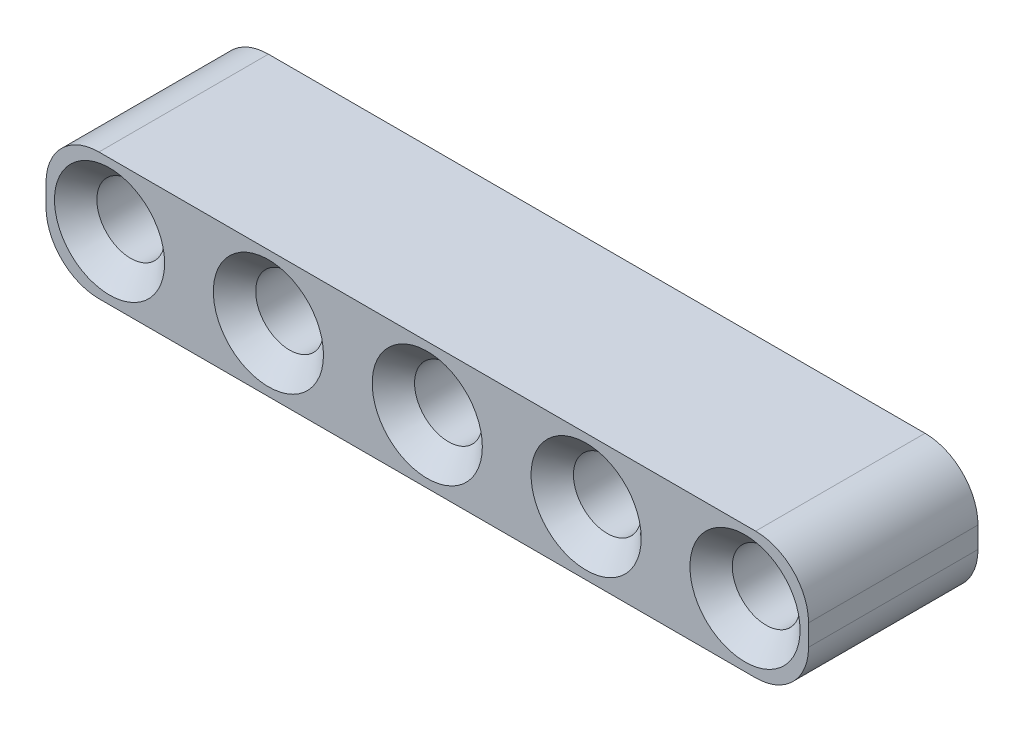
ISO-10303-21;
HEADER;
FILE_DESCRIPTION(('STEP AP214'),'2;1');
FILE_NAME('part.step','',(''),(''),'','','');
FILE_SCHEMA(('AUTOMOTIVE_DESIGN { 1 0 10303 214 1 1 1 1 }'));
ENDSEC;
DATA;
#1=APPLICATION_CONTEXT('core data for automotive mechanical design processes');
#2=APPLICATION_PROTOCOL_DEFINITION('international standard','automotive_design',2000,#1);
#3=PRODUCT_CONTEXT('',#1,'mechanical');
#4=PRODUCT('Part','Part','',(#3));
#5=PRODUCT_RELATED_PRODUCT_CATEGORY('part','',(#4));
#6=PRODUCT_DEFINITION_FORMATION('','',#4);
#7=PRODUCT_DEFINITION_CONTEXT('part definition',#1,'design');
#8=PRODUCT_DEFINITION('design','',#6,#7);
#9=PRODUCT_DEFINITION_SHAPE('','',#8);
#10=(LENGTH_UNIT() NAMED_UNIT(*) SI_UNIT(.MILLI.,.METRE.));
#11=(NAMED_UNIT(*) PLANE_ANGLE_UNIT() SI_UNIT($,.RADIAN.));
#12=(NAMED_UNIT(*) SI_UNIT($,.STERADIAN.) SOLID_ANGLE_UNIT());
#13=UNCERTAINTY_MEASURE_WITH_UNIT(LENGTH_MEASURE(1.E-05),#10,'distance_accuracy_value','');
#14=(GEOMETRIC_REPRESENTATION_CONTEXT(3) GLOBAL_UNCERTAINTY_ASSIGNED_CONTEXT((#13)) GLOBAL_UNIT_ASSIGNED_CONTEXT((#10,
#11,#12)) REPRESENTATION_CONTEXT('',''));
#15=CARTESIAN_POINT('',(0.,0.,0.));
#16=DIRECTION('',(0.,0.,1.));
#17=DIRECTION('',(1.,0.,0.));
#18=AXIS2_PLACEMENT_3D('',#15,#16,#17);
#19=CARTESIAN_POINT('',(30.5,-0.5,8.));
#20=DIRECTION('',(0.,0.,1.));
#21=DIRECTION('',(1.,0.,0.));
#22=AXIS2_PLACEMENT_3D('',#19,#20,#21);
#23=PLANE('',#22);
#24=CARTESIAN_POINT('',(30.,0.,8.));
#25=DIRECTION('',(0.,0.,1.));
#26=DIRECTION('',(1.,0.,0.));
#27=AXIS2_PLACEMENT_3D('',#24,#25,#26);
#28=CIRCLE('',#27,2.6);
#29=CARTESIAN_POINT('',(32.6,0.,8.));
#30=VERTEX_POINT('',#29);
#31=EDGE_CURVE('E192',#30,#30,#28,.F.);
#32=ORIENTED_EDGE('',*,*,#31,.T.);
#33=EDGE_LOOP('',(#32));
#34=FACE_BOUND('',#33,.T.);
#35=CARTESIAN_POINT('',(22.5,0.,8.));
#36=DIRECTION('',(0.,0.,1.));
#37=DIRECTION('',(1.,0.,0.));
#38=AXIS2_PLACEMENT_3D('',#35,#36,#37);
#39=CIRCLE('',#38,2.6);
#40=CARTESIAN_POINT('',(25.1,0.,8.));
#41=VERTEX_POINT('',#40);
#42=EDGE_CURVE('E189',#41,#41,#39,.F.);
#43=ORIENTED_EDGE('',*,*,#42,.T.);
#44=EDGE_LOOP('',(#43));
#45=FACE_BOUND('',#44,.T.);
#46=CARTESIAN_POINT('',(15.,0.,8.));
#47=DIRECTION('',(0.,0.,1.));
#48=DIRECTION('',(1.,0.,0.));
#49=AXIS2_PLACEMENT_3D('',#46,#47,#48);
#50=CIRCLE('',#49,2.6);
#51=CARTESIAN_POINT('',(17.6,0.,8.));
#52=VERTEX_POINT('',#51);
#53=EDGE_CURVE('E186',#52,#52,#50,.F.);
#54=ORIENTED_EDGE('',*,*,#53,.T.);
#55=EDGE_LOOP('',(#54));
#56=FACE_BOUND('',#55,.T.);
#57=CARTESIAN_POINT('',(7.5,0.,8.));
#58=DIRECTION('',(0.,0.,1.));
#59=DIRECTION('',(1.,0.,0.));
#60=AXIS2_PLACEMENT_3D('',#57,#58,#59);
#61=CIRCLE('',#60,2.6);
#62=CARTESIAN_POINT('',(10.1,0.,8.));
#63=VERTEX_POINT('',#62);
#64=EDGE_CURVE('E183',#63,#63,#61,.F.);
#65=ORIENTED_EDGE('',*,*,#64,.T.);
#66=EDGE_LOOP('',(#65));
#67=FACE_BOUND('',#66,.T.);
#68=CARTESIAN_POINT('',(0.,0.,8.));
#69=DIRECTION('',(0.,0.,1.));
#70=DIRECTION('',(1.,0.,0.));
#71=AXIS2_PLACEMENT_3D('',#68,#69,#70);
#72=CIRCLE('',#71,2.6);
#73=CARTESIAN_POINT('',(2.6,0.,8.));
#74=VERTEX_POINT('',#73);
#75=EDGE_CURVE('E180',#74,#74,#72,.F.);
#76=ORIENTED_EDGE('',*,*,#75,.T.);
#77=EDGE_LOOP('',(#76));
#78=FACE_BOUND('',#77,.T.);
#79=CARTESIAN_POINT('',(30.5,-0.5,8.));
#80=DIRECTION('',(0.,0.,1.));
#81=DIRECTION('',(1.,0.,0.));
#82=AXIS2_PLACEMENT_3D('',#79,#80,#81);
#83=CIRCLE('',#82,2.5);
#84=CARTESIAN_POINT('',(30.5,-3.,8.));
#85=VERTEX_POINT('',#84);
#86=CARTESIAN_POINT('',(33.,-0.5,8.));
#87=VERTEX_POINT('',#86);
#88=EDGE_CURVE('E144',#85,#87,#83,.T.);
#89=ORIENTED_EDGE('',*,*,#88,.T.);
#90=DIRECTION('',(0.,1.,0.));
#91=VECTOR('',#90,1.);
#92=CARTESIAN_POINT('',(33.,0.5,8.));
#93=LINE('',#92,#91);
#94=CARTESIAN_POINT('',(33.,0.5,8.));
#95=VERTEX_POINT('',#94);
#96=EDGE_CURVE('E94',#87,#95,#93,.T.);
#97=ORIENTED_EDGE('',*,*,#96,.T.);
#98=CARTESIAN_POINT('',(30.5,0.5,8.));
#99=DIRECTION('',(0.,0.,1.));
#100=DIRECTION('',(-1.,0.,0.));
#101=AXIS2_PLACEMENT_3D('',#98,#99,#100);
#102=CIRCLE('',#101,2.5);
#103=CARTESIAN_POINT('',(30.5,3.,8.));
#104=VERTEX_POINT('',#103);
#105=EDGE_CURVE('E342',#95,#104,#102,.T.);
#106=ORIENTED_EDGE('',*,*,#105,.T.);
#107=DIRECTION('',(-1.,0.,0.));
#108=VECTOR('',#107,1.);
#109=CARTESIAN_POINT('',(-0.5,3.,8.));
#110=LINE('',#109,#108);
#111=CARTESIAN_POINT('',(-0.5,3.,8.));
#112=VERTEX_POINT('',#111);
#113=EDGE_CURVE('E346',#104,#112,#110,.T.);
#114=ORIENTED_EDGE('',*,*,#113,.T.);
#115=CARTESIAN_POINT('',(-0.5,0.5,8.));
#116=DIRECTION('',(0.,0.,1.));
#117=DIRECTION('',(1.,0.,0.));
#118=AXIS2_PLACEMENT_3D('',#115,#116,#117);
#119=CIRCLE('',#118,2.5);
#120=CARTESIAN_POINT('',(-3.,0.5,8.));
#121=VERTEX_POINT('',#120);
#122=EDGE_CURVE('E112',#112,#121,#119,.T.);
#123=ORIENTED_EDGE('',*,*,#122,.T.);
#124=DIRECTION('',(0.,-1.,0.));
#125=VECTOR('',#124,1.);
#126=CARTESIAN_POINT('',(-3.,0.5,8.));
#127=LINE('',#126,#125);
#128=CARTESIAN_POINT('',(-3.,-0.5,8.));
#129=VERTEX_POINT('',#128);
#130=EDGE_CURVE('E107',#121,#129,#127,.T.);
#131=ORIENTED_EDGE('',*,*,#130,.T.);
#132=CARTESIAN_POINT('',(-0.5,-0.5,8.));
#133=DIRECTION('',(0.,0.,1.));
#134=DIRECTION('',(1.,0.,0.));
#135=AXIS2_PLACEMENT_3D('',#132,#133,#134);
#136=CIRCLE('',#135,2.5);
#137=CARTESIAN_POINT('',(-0.5,-3.,8.));
#138=VERTEX_POINT('',#137);
#139=EDGE_CURVE('E110',#129,#138,#136,.T.);
#140=ORIENTED_EDGE('',*,*,#139,.T.);
#141=DIRECTION('',(1.,0.,0.));
#142=VECTOR('',#141,1.);
#143=CARTESIAN_POINT('',(-0.5,-3.,8.));
#144=LINE('',#143,#142);
#145=EDGE_CURVE('E50',#138,#85,#144,.T.);
#146=ORIENTED_EDGE('',*,*,#145,.T.);
#147=EDGE_LOOP('',(#89,#97,#106,#114,#123,#131,#140,#146));
#148=FACE_BOUND('',#147,.T.);
#149=ADVANCED_FACE('F33',(#34,#45,#56,#67,#78,#148),#23,.T.);
#150=CARTESIAN_POINT('',(30.5,-0.5,0.));
#151=DIRECTION('',(0.,0.,1.));
#152=DIRECTION('',(1.,0.,0.));
#153=AXIS2_PLACEMENT_3D('',#150,#151,#152);
#154=PLANE('',#153);
#155=CARTESIAN_POINT('',(30.,0.,0.));
#156=DIRECTION('',(0.,0.,1.));
#157=DIRECTION('',(1.,0.,0.));
#158=AXIS2_PLACEMENT_3D('',#155,#156,#157);
#159=CIRCLE('',#158,2.6);
#160=CARTESIAN_POINT('',(32.6,0.,0.));
#161=VERTEX_POINT('',#160);
#162=EDGE_CURVE('E171',#161,#161,#159,.T.);
#163=ORIENTED_EDGE('',*,*,#162,.T.);
#164=EDGE_LOOP('',(#163));
#165=FACE_BOUND('',#164,.T.);
#166=CARTESIAN_POINT('',(22.5,0.,0.));
#167=DIRECTION('',(0.,0.,1.));
#168=DIRECTION('',(1.,0.,0.));
#169=AXIS2_PLACEMENT_3D('',#166,#167,#168);
#170=CIRCLE('',#169,2.59999999999999);
#171=CARTESIAN_POINT('',(25.1,0.,0.));
#172=VERTEX_POINT('',#171);
#173=EDGE_CURVE('E168',#172,#172,#170,.T.);
#174=ORIENTED_EDGE('',*,*,#173,.T.);
#175=EDGE_LOOP('',(#174));
#176=FACE_BOUND('',#175,.T.);
#177=CARTESIAN_POINT('',(15.,0.,0.));
#178=DIRECTION('',(0.,0.,1.));
#179=DIRECTION('',(1.,0.,0.));
#180=AXIS2_PLACEMENT_3D('',#177,#178,#179);
#181=CIRCLE('',#180,2.59999999999999);
#182=CARTESIAN_POINT('',(17.6,0.,0.));
#183=VERTEX_POINT('',#182);
#184=EDGE_CURVE('E165',#183,#183,#181,.T.);
#185=ORIENTED_EDGE('',*,*,#184,.T.);
#186=EDGE_LOOP('',(#185));
#187=FACE_BOUND('',#186,.T.);
#188=CARTESIAN_POINT('',(7.5,0.,0.));
#189=DIRECTION('',(0.,0.,1.));
#190=DIRECTION('',(1.,0.,0.));
#191=AXIS2_PLACEMENT_3D('',#188,#189,#190);
#192=CIRCLE('',#191,2.6);
#193=CARTESIAN_POINT('',(10.1,0.,0.));
#194=VERTEX_POINT('',#193);
#195=EDGE_CURVE('E162',#194,#194,#192,.T.);
#196=ORIENTED_EDGE('',*,*,#195,.T.);
#197=EDGE_LOOP('',(#196));
#198=FACE_BOUND('',#197,.T.);
#199=CARTESIAN_POINT('',(0.,0.,0.));
#200=DIRECTION('',(0.,0.,1.));
#201=DIRECTION('',(1.,0.,0.));
#202=AXIS2_PLACEMENT_3D('',#199,#200,#201);
#203=CIRCLE('',#202,2.6);
#204=CARTESIAN_POINT('',(2.6,0.,0.));
#205=VERTEX_POINT('',#204);
#206=EDGE_CURVE('E159',#205,#205,#203,.T.);
#207=ORIENTED_EDGE('',*,*,#206,.T.);
#208=EDGE_LOOP('',(#207));
#209=FACE_BOUND('',#208,.T.);
#210=CARTESIAN_POINT('',(30.5,-0.5,0.));
#211=DIRECTION('',(0.,0.,1.));
#212=DIRECTION('',(1.,0.,0.));
#213=AXIS2_PLACEMENT_3D('',#210,#211,#212);
#214=CIRCLE('',#213,2.5);
#215=CARTESIAN_POINT('',(30.5,-3.,0.));
#216=VERTEX_POINT('',#215);
#217=CARTESIAN_POINT('',(33.,-0.5,0.));
#218=VERTEX_POINT('',#217);
#219=EDGE_CURVE('E130',#216,#218,#214,.T.);
#220=ORIENTED_EDGE('',*,*,#219,.F.);
#221=DIRECTION('',(1.,0.,0.));
#222=VECTOR('',#221,1.);
#223=CARTESIAN_POINT('',(-0.5,-3.,0.));
#224=LINE('',#223,#222);
#225=CARTESIAN_POINT('',(-0.5,-3.,0.));
#226=VERTEX_POINT('',#225);
#227=EDGE_CURVE('E85',#226,#216,#224,.T.);
#228=ORIENTED_EDGE('',*,*,#227,.F.);
#229=CARTESIAN_POINT('',(-0.5,-0.5,0.));
#230=DIRECTION('',(0.,0.,1.));
#231=DIRECTION('',(1.,0.,0.));
#232=AXIS2_PLACEMENT_3D('',#229,#230,#231);
#233=CIRCLE('',#232,2.5);
#234=CARTESIAN_POINT('',(-3.,-0.5,0.));
#235=VERTEX_POINT('',#234);
#236=EDGE_CURVE('E79',#235,#226,#233,.T.);
#237=ORIENTED_EDGE('',*,*,#236,.F.);
#238=DIRECTION('',(0.,-1.,0.));
#239=VECTOR('',#238,1.);
#240=CARTESIAN_POINT('',(-3.,0.5,0.));
#241=LINE('',#240,#239);
#242=CARTESIAN_POINT('',(-3.,0.5,0.));
#243=VERTEX_POINT('',#242);
#244=EDGE_CURVE('E120',#243,#235,#241,.T.);
#245=ORIENTED_EDGE('',*,*,#244,.F.);
#246=CARTESIAN_POINT('',(-0.5,0.5,0.));
#247=DIRECTION('',(0.,0.,1.));
#248=DIRECTION('',(1.,0.,0.));
#249=AXIS2_PLACEMENT_3D('',#246,#247,#248);
#250=CIRCLE('',#249,2.5);
#251=CARTESIAN_POINT('',(-0.5,3.,0.));
#252=VERTEX_POINT('',#251);
#253=EDGE_CURVE('E139',#252,#243,#250,.T.);
#254=ORIENTED_EDGE('',*,*,#253,.F.);
#255=DIRECTION('',(-1.,0.,0.));
#256=VECTOR('',#255,1.);
#257=CARTESIAN_POINT('',(-0.5,3.,0.));
#258=LINE('',#257,#256);
#259=CARTESIAN_POINT('',(30.5,3.,0.));
#260=VERTEX_POINT('',#259);
#261=EDGE_CURVE('E137',#260,#252,#258,.T.);
#262=ORIENTED_EDGE('',*,*,#261,.F.);
#263=CARTESIAN_POINT('',(30.5,0.5,0.));
#264=DIRECTION('',(0.,0.,1.));
#265=DIRECTION('',(-1.,0.,0.));
#266=AXIS2_PLACEMENT_3D('',#263,#264,#265);
#267=CIRCLE('',#266,2.5);
#268=CARTESIAN_POINT('',(33.,0.5,0.));
#269=VERTEX_POINT('',#268);
#270=EDGE_CURVE('E135',#269,#260,#267,.T.);
#271=ORIENTED_EDGE('',*,*,#270,.F.);
#272=DIRECTION('',(0.,1.,0.));
#273=VECTOR('',#272,1.);
#274=CARTESIAN_POINT('',(33.,0.5,0.));
#275=LINE('',#274,#273);
#276=EDGE_CURVE('E133',#218,#269,#275,.T.);
#277=ORIENTED_EDGE('',*,*,#276,.F.);
#278=EDGE_LOOP('',(#220,#228,#237,#245,#254,#262,#271,#277));
#279=FACE_BOUND('',#278,.T.);
#280=ADVANCED_FACE('F227',(#165,#176,#187,#198,#209,#279),#154,.F.);
#281=CARTESIAN_POINT('',(30.5,-0.5,8.));
#282=DIRECTION('',(0.,0.,-1.));
#283=DIRECTION('',(-1.,0.,0.));
#284=AXIS2_PLACEMENT_3D('',#281,#282,#283);
#285=CYLINDRICAL_SURFACE('',#284,2.5);
#286=ORIENTED_EDGE('',*,*,#219,.T.);
#287=DIRECTION('',(0.,0.,-1.));
#288=VECTOR('',#287,1.);
#289=CARTESIAN_POINT('',(33.,-0.5,8.));
#290=LINE('',#289,#288);
#291=EDGE_CURVE('E157',#87,#218,#290,.T.);
#292=ORIENTED_EDGE('',*,*,#291,.F.);
#293=ORIENTED_EDGE('',*,*,#88,.F.);
#294=DIRECTION('',(0.,0.,-1.));
#295=VECTOR('',#294,1.);
#296=CARTESIAN_POINT('',(30.5,-3.,8.));
#297=LINE('',#296,#295);
#298=EDGE_CURVE('E126',#85,#216,#297,.T.);
#299=ORIENTED_EDGE('',*,*,#298,.T.);
#300=EDGE_LOOP('',(#286,#292,#293,#299));
#301=FACE_BOUND('',#300,.T.);
#302=ADVANCED_FACE('F233',(#301),#285,.T.);
#303=CARTESIAN_POINT('',(33.,0.5,8.));
#304=DIRECTION('',(-1.,0.,0.));
#305=DIRECTION('',(0.,0.,1.));
#306=AXIS2_PLACEMENT_3D('',#303,#304,#305);
#307=PLANE('',#306);
#308=ORIENTED_EDGE('',*,*,#276,.T.);
#309=DIRECTION('',(0.,0.,-1.));
#310=VECTOR('',#309,1.);
#311=CARTESIAN_POINT('',(33.,0.5,8.));
#312=LINE('',#311,#310);
#313=EDGE_CURVE('E154',#95,#269,#312,.T.);
#314=ORIENTED_EDGE('',*,*,#313,.F.);
#315=ORIENTED_EDGE('',*,*,#96,.F.);
#316=ORIENTED_EDGE('',*,*,#291,.T.);
#317=EDGE_LOOP('',(#308,#314,#315,#316));
#318=FACE_BOUND('',#317,.T.);
#319=ADVANCED_FACE('F258',(#318),#307,.F.);
#320=CARTESIAN_POINT('',(30.5,0.5,8.));
#321=DIRECTION('',(0.,0.,-1.));
#322=DIRECTION('',(-1.,0.,0.));
#323=AXIS2_PLACEMENT_3D('',#320,#321,#322);
#324=CYLINDRICAL_SURFACE('',#323,2.5);
#325=ORIENTED_EDGE('',*,*,#270,.T.);
#326=DIRECTION('',(0.,0.,-1.));
#327=VECTOR('',#326,1.);
#328=CARTESIAN_POINT('',(30.5,3.,8.));
#329=LINE('',#328,#327);
#330=EDGE_CURVE('E151',#104,#260,#329,.T.);
#331=ORIENTED_EDGE('',*,*,#330,.F.);
#332=ORIENTED_EDGE('',*,*,#105,.F.);
#333=ORIENTED_EDGE('',*,*,#313,.T.);
#334=EDGE_LOOP('',(#325,#331,#332,#333));
#335=FACE_BOUND('',#334,.T.);
#336=ADVANCED_FACE('F254',(#335),#324,.T.);
#337=CARTESIAN_POINT('',(-0.5,3.,8.));
#338=DIRECTION('',(0.,-1.,0.));
#339=DIRECTION('',(1.,0.,0.));
#340=AXIS2_PLACEMENT_3D('',#337,#338,#339);
#341=PLANE('',#340);
#342=ORIENTED_EDGE('',*,*,#261,.T.);
#343=DIRECTION('',(0.,0.,-1.));
#344=VECTOR('',#343,1.);
#345=CARTESIAN_POINT('',(-0.5,3.,8.));
#346=LINE('',#345,#344);
#347=EDGE_CURVE('E148',#112,#252,#346,.T.);
#348=ORIENTED_EDGE('',*,*,#347,.F.);
#349=ORIENTED_EDGE('',*,*,#113,.F.);
#350=ORIENTED_EDGE('',*,*,#330,.T.);
#351=EDGE_LOOP('',(#342,#348,#349,#350));
#352=FACE_BOUND('',#351,.T.);
#353=ADVANCED_FACE('F250',(#352),#341,.F.);
#354=CARTESIAN_POINT('',(-0.5,0.5,8.));
#355=DIRECTION('',(0.,0.,-1.));
#356=DIRECTION('',(-1.,0.,0.));
#357=AXIS2_PLACEMENT_3D('',#354,#355,#356);
#358=CYLINDRICAL_SURFACE('',#357,2.5);
#359=ORIENTED_EDGE('',*,*,#253,.T.);
#360=DIRECTION('',(0.,0.,-1.));
#361=VECTOR('',#360,1.);
#362=CARTESIAN_POINT('',(-3.,0.5,8.));
#363=LINE('',#362,#361);
#364=EDGE_CURVE('E121',#121,#243,#363,.T.);
#365=ORIENTED_EDGE('',*,*,#364,.F.);
#366=ORIENTED_EDGE('',*,*,#122,.F.);
#367=ORIENTED_EDGE('',*,*,#347,.T.);
#368=EDGE_LOOP('',(#359,#365,#366,#367));
#369=FACE_BOUND('',#368,.T.);
#370=ADVANCED_FACE('F247',(#369),#358,.T.);
#371=CARTESIAN_POINT('',(-3.,0.5,8.));
#372=DIRECTION('',(1.,0.,0.));
#373=DIRECTION('',(0.,0.,-1.));
#374=AXIS2_PLACEMENT_3D('',#371,#372,#373);
#375=PLANE('',#374);
#376=ORIENTED_EDGE('',*,*,#244,.T.);
#377=DIRECTION('',(0.,0.,-1.));
#378=VECTOR('',#377,1.);
#379=CARTESIAN_POINT('',(-3.,-0.5,8.));
#380=LINE('',#379,#378);
#381=EDGE_CURVE('E117',#129,#235,#380,.T.);
#382=ORIENTED_EDGE('',*,*,#381,.F.);
#383=ORIENTED_EDGE('',*,*,#130,.F.);
#384=ORIENTED_EDGE('',*,*,#364,.T.);
#385=EDGE_LOOP('',(#376,#382,#383,#384));
#386=FACE_BOUND('',#385,.T.);
#387=ADVANCED_FACE('F118',(#386),#375,.F.);
#388=CARTESIAN_POINT('',(-0.5,-0.5,8.));
#389=DIRECTION('',(0.,0.,-1.));
#390=DIRECTION('',(-1.,0.,0.));
#391=AXIS2_PLACEMENT_3D('',#388,#389,#390);
#392=CYLINDRICAL_SURFACE('',#391,2.5);
#393=ORIENTED_EDGE('',*,*,#236,.T.);
#394=DIRECTION('',(0.,0.,-1.));
#395=VECTOR('',#394,1.);
#396=CARTESIAN_POINT('',(-0.5,-3.,8.));
#397=LINE('',#396,#395);
#398=EDGE_CURVE('E122',#138,#226,#397,.T.);
#399=ORIENTED_EDGE('',*,*,#398,.F.);
#400=ORIENTED_EDGE('',*,*,#139,.F.);
#401=ORIENTED_EDGE('',*,*,#381,.T.);
#402=EDGE_LOOP('',(#393,#399,#400,#401));
#403=FACE_BOUND('',#402,.T.);
#404=ADVANCED_FACE('F124',(#403),#392,.T.);
#405=CARTESIAN_POINT('',(-0.5,-3.,8.));
#406=DIRECTION('',(0.,1.,0.));
#407=DIRECTION('',(-1.,0.,0.));
#408=AXIS2_PLACEMENT_3D('',#405,#406,#407);
#409=PLANE('',#408);
#410=ORIENTED_EDGE('',*,*,#227,.T.);
#411=ORIENTED_EDGE('',*,*,#298,.F.);
#412=ORIENTED_EDGE('',*,*,#145,.F.);
#413=ORIENTED_EDGE('',*,*,#398,.T.);
#414=EDGE_LOOP('',(#410,#411,#412,#413));
#415=FACE_BOUND('',#414,.T.);
#416=ADVANCED_FACE('F240',(#415),#409,.F.);
#417=CARTESIAN_POINT('',(0.,0.,8.));
#418=DIRECTION('',(0.,0.,-1.));
#419=DIRECTION('',(-1.,0.,0.));
#420=AXIS2_PLACEMENT_3D('',#417,#418,#419);
#421=CYLINDRICAL_SURFACE('',#420,1.6);
#422=CARTESIAN_POINT('',(0.,0.,1.00000000000001));
#423=DIRECTION('',(0.,0.,1.));
#424=DIRECTION('',(1.,0.,0.));
#425=AXIS2_PLACEMENT_3D('',#422,#423,#424);
#426=CIRCLE('',#425,1.6);
#427=CARTESIAN_POINT('',(1.6,0.,1.00000000000001));
#428=VERTEX_POINT('',#427);
#429=EDGE_CURVE('E11',#428,#428,#426,.F.);
#430=ORIENTED_EDGE('',*,*,#429,.T.);
#431=EDGE_LOOP('',(#430));
#432=FACE_BOUND('',#431,.T.);
#433=CARTESIAN_POINT('',(0.,0.,7.));
#434=DIRECTION('',(0.,0.,1.));
#435=DIRECTION('',(1.,0.,0.));
#436=AXIS2_PLACEMENT_3D('',#433,#434,#435);
#437=CIRCLE('',#436,1.6);
#438=CARTESIAN_POINT('',(1.6,0.,7.));
#439=VERTEX_POINT('',#438);
#440=EDGE_CURVE('E42',#439,#439,#437,.T.);
#441=ORIENTED_EDGE('',*,*,#440,.T.);
#442=EDGE_LOOP('',(#441));
#443=FACE_BOUND('',#442,.T.);
#444=ADVANCED_FACE('F215',(#432,#443),#421,.F.);
#445=CARTESIAN_POINT('',(7.5,0.,8.));
#446=DIRECTION('',(0.,0.,-1.));
#447=DIRECTION('',(-1.,0.,0.));
#448=AXIS2_PLACEMENT_3D('',#445,#446,#447);
#449=CYLINDRICAL_SURFACE('',#448,1.6);
#450=CARTESIAN_POINT('',(7.5,0.,1.));
#451=DIRECTION('',(0.,0.,1.));
#452=DIRECTION('',(1.,0.,0.));
#453=AXIS2_PLACEMENT_3D('',#450,#451,#452);
#454=CIRCLE('',#453,1.6);
#455=CARTESIAN_POINT('',(9.1,0.,1.));
#456=VERTEX_POINT('',#455);
#457=EDGE_CURVE('E210',#456,#456,#454,.F.);
#458=ORIENTED_EDGE('',*,*,#457,.T.);
#459=EDGE_LOOP('',(#458));
#460=FACE_BOUND('',#459,.T.);
#461=CARTESIAN_POINT('',(7.5,0.,7.00000000000001));
#462=DIRECTION('',(0.,0.,1.));
#463=DIRECTION('',(1.,0.,0.));
#464=AXIS2_PLACEMENT_3D('',#461,#462,#463);
#465=CIRCLE('',#464,1.6);
#466=CARTESIAN_POINT('',(9.1,0.,7.00000000000001));
#467=VERTEX_POINT('',#466);
#468=EDGE_CURVE('E207',#467,#467,#465,.T.);
#469=ORIENTED_EDGE('',*,*,#468,.T.);
#470=EDGE_LOOP('',(#469));
#471=FACE_BOUND('',#470,.T.);
#472=ADVANCED_FACE('F302',(#460,#471),#449,.F.);
#473=CARTESIAN_POINT('',(15.,0.,8.));
#474=DIRECTION('',(0.,0.,-1.));
#475=DIRECTION('',(-1.,0.,0.));
#476=AXIS2_PLACEMENT_3D('',#473,#474,#475);
#477=CYLINDRICAL_SURFACE('',#476,1.6);
#478=CARTESIAN_POINT('',(15.,0.,0.999999999999997));
#479=DIRECTION('',(0.,0.,1.));
#480=DIRECTION('',(1.,0.,0.));
#481=AXIS2_PLACEMENT_3D('',#478,#479,#480);
#482=CIRCLE('',#481,1.6);
#483=CARTESIAN_POINT('',(16.6,0.,0.999999999999997));
#484=VERTEX_POINT('',#483);
#485=EDGE_CURVE('E204',#484,#484,#482,.F.);
#486=ORIENTED_EDGE('',*,*,#485,.T.);
#487=EDGE_LOOP('',(#486));
#488=FACE_BOUND('',#487,.T.);
#489=CARTESIAN_POINT('',(15.,0.,7.));
#490=DIRECTION('',(0.,0.,1.));
#491=DIRECTION('',(1.,0.,0.));
#492=AXIS2_PLACEMENT_3D('',#489,#490,#491);
#493=CIRCLE('',#492,1.6);
#494=CARTESIAN_POINT('',(16.6,0.,7.));
#495=VERTEX_POINT('',#494);
#496=EDGE_CURVE('E201',#495,#495,#493,.T.);
#497=ORIENTED_EDGE('',*,*,#496,.T.);
#498=EDGE_LOOP('',(#497));
#499=FACE_BOUND('',#498,.T.);
#500=ADVANCED_FACE('F304',(#488,#499),#477,.F.);
#501=CARTESIAN_POINT('',(22.5,0.,8.));
#502=DIRECTION('',(0.,0.,-1.));
#503=DIRECTION('',(-1.,0.,0.));
#504=AXIS2_PLACEMENT_3D('',#501,#502,#503);
#505=CYLINDRICAL_SURFACE('',#504,1.6);
#506=CARTESIAN_POINT('',(22.5,0.,0.999999999999997));
#507=DIRECTION('',(0.,0.,1.));
#508=DIRECTION('',(1.,0.,0.));
#509=AXIS2_PLACEMENT_3D('',#506,#507,#508);
#510=CIRCLE('',#509,1.6);
#511=CARTESIAN_POINT('',(24.1,0.,0.999999999999997));
#512=VERTEX_POINT('',#511);
#513=EDGE_CURVE('E198',#512,#512,#510,.F.);
#514=ORIENTED_EDGE('',*,*,#513,.T.);
#515=EDGE_LOOP('',(#514));
#516=FACE_BOUND('',#515,.T.);
#517=CARTESIAN_POINT('',(22.5,0.,7.));
#518=DIRECTION('',(0.,0.,1.));
#519=DIRECTION('',(1.,0.,0.));
#520=AXIS2_PLACEMENT_3D('',#517,#518,#519);
#521=CIRCLE('',#520,1.6);
#522=CARTESIAN_POINT('',(24.1,0.,7.));
#523=VERTEX_POINT('',#522);
#524=EDGE_CURVE('E195',#523,#523,#521,.T.);
#525=ORIENTED_EDGE('',*,*,#524,.T.);
#526=EDGE_LOOP('',(#525));
#527=FACE_BOUND('',#526,.T.);
#528=ADVANCED_FACE('F310',(#516,#527),#505,.F.);
#529=CARTESIAN_POINT('',(30.,0.,8.));
#530=DIRECTION('',(0.,0.,-1.));
#531=DIRECTION('',(-1.,0.,0.));
#532=AXIS2_PLACEMENT_3D('',#529,#530,#531);
#533=CYLINDRICAL_SURFACE('',#532,1.6);
#534=CARTESIAN_POINT('',(30.,0.,0.999999999999997));
#535=DIRECTION('',(0.,0.,1.));
#536=DIRECTION('',(1.,0.,0.));
#537=AXIS2_PLACEMENT_3D('',#534,#535,#536);
#538=CIRCLE('',#537,1.6);
#539=CARTESIAN_POINT('',(31.6,0.,0.999999999999997));
#540=VERTEX_POINT('',#539);
#541=EDGE_CURVE('E177',#540,#540,#538,.F.);
#542=ORIENTED_EDGE('',*,*,#541,.T.);
#543=EDGE_LOOP('',(#542));
#544=FACE_BOUND('',#543,.T.);
#545=CARTESIAN_POINT('',(30.,0.,7.));
#546=DIRECTION('',(0.,0.,1.));
#547=DIRECTION('',(1.,0.,0.));
#548=AXIS2_PLACEMENT_3D('',#545,#546,#547);
#549=CIRCLE('',#548,1.6);
#550=CARTESIAN_POINT('',(31.6,0.,7.));
#551=VERTEX_POINT('',#550);
#552=EDGE_CURVE('E174',#551,#551,#549,.T.);
#553=ORIENTED_EDGE('',*,*,#552,.T.);
#554=EDGE_LOOP('',(#553));
#555=FACE_BOUND('',#554,.T.);
#556=ADVANCED_FACE('F269',(#544,#555),#533,.F.);
#557=CARTESIAN_POINT('',(30.,0.,0.));
#558=DIRECTION('',(0.,0.,-1.));
#559=DIRECTION('',(-1.,0.,0.));
#560=AXIS2_PLACEMENT_3D('',#557,#558,#559);
#561=CONICAL_SURFACE('',#560,2.59999999999999,0.785398163397448);
#562=ORIENTED_EDGE('',*,*,#541,.F.);
#563=EDGE_LOOP('',(#562));
#564=FACE_BOUND('',#563,.T.);
#565=ORIENTED_EDGE('',*,*,#162,.F.);
#566=EDGE_LOOP('',(#565));
#567=FACE_BOUND('',#566,.T.);
#568=ADVANCED_FACE('F265',(#564,#567),#561,.F.);
#569=CARTESIAN_POINT('',(30.,0.,7.));
#570=DIRECTION('',(0.,0.,1.));
#571=DIRECTION('',(1.,0.,0.));
#572=AXIS2_PLACEMENT_3D('',#569,#570,#571);
#573=CONICAL_SURFACE('',#572,1.6,0.78539816339745);
#574=ORIENTED_EDGE('',*,*,#31,.F.);
#575=EDGE_LOOP('',(#574));
#576=FACE_BOUND('',#575,.T.);
#577=ORIENTED_EDGE('',*,*,#552,.F.);
#578=EDGE_LOOP('',(#577));
#579=FACE_BOUND('',#578,.T.);
#580=ADVANCED_FACE('F268',(#576,#579),#573,.F.);
#581=CARTESIAN_POINT('',(22.5,0.,0.));
#582=DIRECTION('',(0.,0.,-1.));
#583=DIRECTION('',(-1.,0.,0.));
#584=AXIS2_PLACEMENT_3D('',#581,#582,#583);
#585=CONICAL_SURFACE('',#584,2.59999999999999,0.785398163397448);
#586=ORIENTED_EDGE('',*,*,#513,.F.);
#587=EDGE_LOOP('',(#586));
#588=FACE_BOUND('',#587,.T.);
#589=ORIENTED_EDGE('',*,*,#173,.F.);
#590=EDGE_LOOP('',(#589));
#591=FACE_BOUND('',#590,.T.);
#592=ADVANCED_FACE('F273',(#588,#591),#585,.F.);
#593=CARTESIAN_POINT('',(22.5,0.,7.));
#594=DIRECTION('',(0.,0.,1.));
#595=DIRECTION('',(1.,0.,0.));
#596=AXIS2_PLACEMENT_3D('',#593,#594,#595);
#597=CONICAL_SURFACE('',#596,1.6,0.78539816339745);
#598=ORIENTED_EDGE('',*,*,#42,.F.);
#599=EDGE_LOOP('',(#598));
#600=FACE_BOUND('',#599,.T.);
#601=ORIENTED_EDGE('',*,*,#524,.F.);
#602=EDGE_LOOP('',(#601));
#603=FACE_BOUND('',#602,.T.);
#604=ADVANCED_FACE('F277',(#600,#603),#597,.F.);
#605=CARTESIAN_POINT('',(15.,0.,0.));
#606=DIRECTION('',(0.,0.,-1.));
#607=DIRECTION('',(-1.,0.,0.));
#608=AXIS2_PLACEMENT_3D('',#605,#606,#607);
#609=CONICAL_SURFACE('',#608,2.59999999999999,0.785398163397448);
#610=ORIENTED_EDGE('',*,*,#485,.F.);
#611=EDGE_LOOP('',(#610));
#612=FACE_BOUND('',#611,.T.);
#613=ORIENTED_EDGE('',*,*,#184,.F.);
#614=EDGE_LOOP('',(#613));
#615=FACE_BOUND('',#614,.T.);
#616=ADVANCED_FACE('F281',(#612,#615),#609,.F.);
#617=CARTESIAN_POINT('',(15.,0.,7.));
#618=DIRECTION('',(0.,0.,1.));
#619=DIRECTION('',(1.,0.,0.));
#620=AXIS2_PLACEMENT_3D('',#617,#618,#619);
#621=CONICAL_SURFACE('',#620,1.6,0.78539816339745);
#622=ORIENTED_EDGE('',*,*,#53,.F.);
#623=EDGE_LOOP('',(#622));
#624=FACE_BOUND('',#623,.T.);
#625=ORIENTED_EDGE('',*,*,#496,.F.);
#626=EDGE_LOOP('',(#625));
#627=FACE_BOUND('',#626,.T.);
#628=ADVANCED_FACE('F285',(#624,#627),#621,.F.);
#629=CARTESIAN_POINT('',(7.5,0.,0.));
#630=DIRECTION('',(0.,0.,-1.));
#631=DIRECTION('',(-1.,0.,0.));
#632=AXIS2_PLACEMENT_3D('',#629,#630,#631);
#633=CONICAL_SURFACE('',#632,2.6,0.785398163397448);
#634=ORIENTED_EDGE('',*,*,#457,.F.);
#635=EDGE_LOOP('',(#634));
#636=FACE_BOUND('',#635,.T.);
#637=ORIENTED_EDGE('',*,*,#195,.F.);
#638=EDGE_LOOP('',(#637));
#639=FACE_BOUND('',#638,.T.);
#640=ADVANCED_FACE('F289',(#636,#639),#633,.F.);
#641=CARTESIAN_POINT('',(7.5,0.,7.00000000000001));
#642=DIRECTION('',(0.,0.,1.));
#643=DIRECTION('',(1.,0.,0.));
#644=AXIS2_PLACEMENT_3D('',#641,#642,#643);
#645=CONICAL_SURFACE('',#644,1.6,0.785398163397449);
#646=ORIENTED_EDGE('',*,*,#64,.F.);
#647=EDGE_LOOP('',(#646));
#648=FACE_BOUND('',#647,.T.);
#649=ORIENTED_EDGE('',*,*,#468,.F.);
#650=EDGE_LOOP('',(#649));
#651=FACE_BOUND('',#650,.T.);
#652=ADVANCED_FACE('F223',(#648,#651),#645,.F.);
#653=CARTESIAN_POINT('',(0.,0.,0.));
#654=DIRECTION('',(0.,0.,-1.));
#655=DIRECTION('',(-1.,0.,0.));
#656=AXIS2_PLACEMENT_3D('',#653,#654,#655);
#657=CONICAL_SURFACE('',#656,2.6,0.785398163397448);
#658=ORIENTED_EDGE('',*,*,#429,.F.);
#659=EDGE_LOOP('',(#658));
#660=FACE_BOUND('',#659,.T.);
#661=ORIENTED_EDGE('',*,*,#206,.F.);
#662=EDGE_LOOP('',(#661));
#663=FACE_BOUND('',#662,.T.);
#664=ADVANCED_FACE('F218',(#660,#663),#657,.F.);
#665=CARTESIAN_POINT('',(0.,0.,7.));
#666=DIRECTION('',(0.,0.,1.));
#667=DIRECTION('',(1.,0.,0.));
#668=AXIS2_PLACEMENT_3D('',#665,#666,#667);
#669=CONICAL_SURFACE('',#668,1.6,0.785398163397449);
#670=ORIENTED_EDGE('',*,*,#75,.F.);
#671=EDGE_LOOP('',(#670));
#672=FACE_BOUND('',#671,.T.);
#673=ORIENTED_EDGE('',*,*,#440,.F.);
#674=EDGE_LOOP('',(#673));
#675=FACE_BOUND('',#674,.T.);
#676=ADVANCED_FACE('F35',(#672,#675),#669,.F.);
#677=CLOSED_SHELL('',(#149,#280,#302,#319,#336,#353,#370,#387,#404,#416,#444,#472,#500,#528,
#556,#568,#580,#592,#604,#616,#628,#640,#652,#664,#676));
#678=MANIFOLD_SOLID_BREP('B2',#677);
#679=ADVANCED_BREP_SHAPE_REPRESENTATION('',(#18,#678),#14);
#680=SHAPE_DEFINITION_REPRESENTATION(#9,#679);
ENDSEC;
END-ISO-10303-21;
